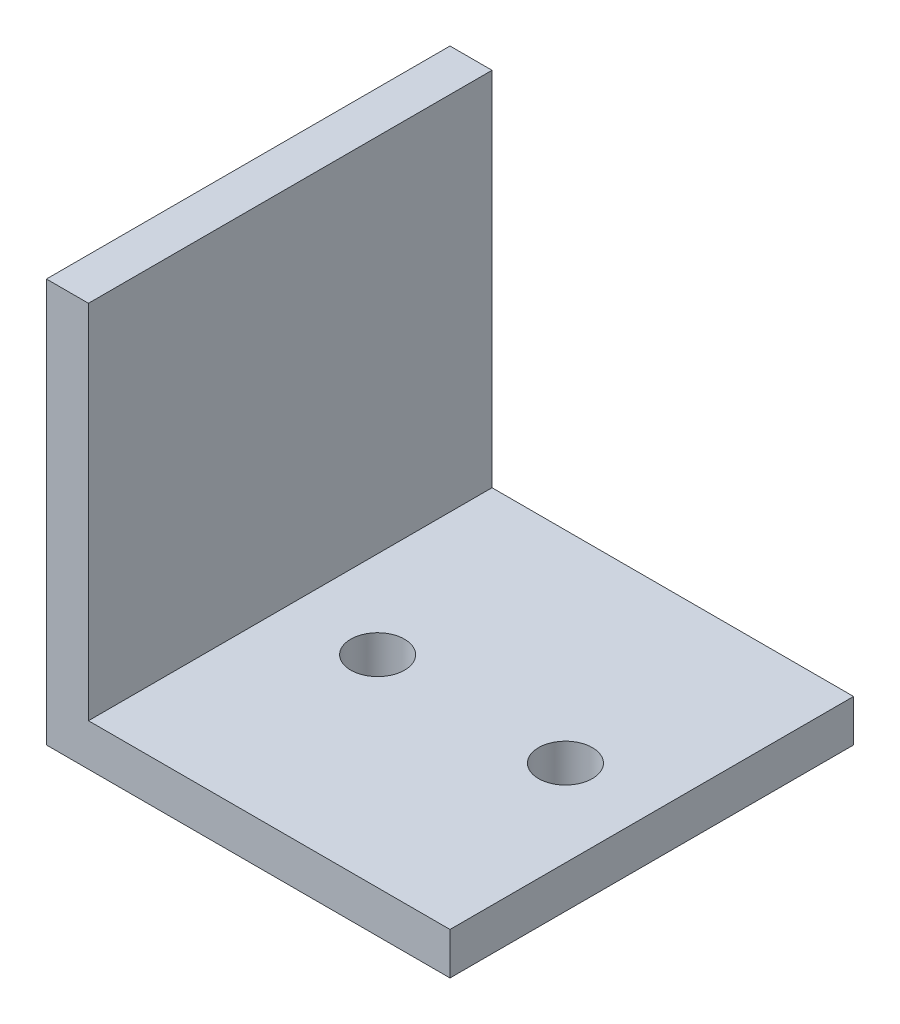
ISO-10303-21;
HEADER;
FILE_DESCRIPTION(('STEP AP214'),'2;1');
FILE_NAME('part.step','',(''),(''),'','','');
FILE_SCHEMA(('AUTOMOTIVE_DESIGN { 1 0 10303 214 1 1 1 1 }'));
ENDSEC;
DATA;
#1=APPLICATION_CONTEXT('core data for automotive mechanical design processes');
#2=APPLICATION_PROTOCOL_DEFINITION('international standard','automotive_design',2000,#1);
#3=PRODUCT_CONTEXT('',#1,'mechanical');
#4=PRODUCT('Part','Part','',(#3));
#5=PRODUCT_RELATED_PRODUCT_CATEGORY('part','',(#4));
#6=PRODUCT_DEFINITION_FORMATION('','',#4);
#7=PRODUCT_DEFINITION_CONTEXT('part definition',#1,'design');
#8=PRODUCT_DEFINITION('design','',#6,#7);
#9=PRODUCT_DEFINITION_SHAPE('','',#8);
#10=(LENGTH_UNIT() NAMED_UNIT(*) SI_UNIT(.MILLI.,.METRE.));
#11=(NAMED_UNIT(*) PLANE_ANGLE_UNIT() SI_UNIT($,.RADIAN.));
#12=(NAMED_UNIT(*) SI_UNIT($,.STERADIAN.) SOLID_ANGLE_UNIT());
#13=UNCERTAINTY_MEASURE_WITH_UNIT(LENGTH_MEASURE(1.E-05),#10,'distance_accuracy_value','');
#14=(GEOMETRIC_REPRESENTATION_CONTEXT(3) GLOBAL_UNCERTAINTY_ASSIGNED_CONTEXT((#13)) GLOBAL_UNIT_ASSIGNED_CONTEXT((#10,
#11,#12)) REPRESENTATION_CONTEXT('',''));
#15=CARTESIAN_POINT('',(0.,0.,0.));
#16=DIRECTION('',(0.,0.,1.));
#17=DIRECTION('',(1.,0.,0.));
#18=AXIS2_PLACEMENT_3D('',#15,#16,#17);
#19=CARTESIAN_POINT('',(-26.875,0.,30.));
#20=DIRECTION('',(-1.,0.,0.));
#21=DIRECTION('',(0.,0.,1.));
#22=AXIS2_PLACEMENT_3D('',#19,#20,#21);
#23=PLANE('',#22);
#24=DIRECTION('',(0.,1.,0.));
#25=VECTOR('',#24,1.);
#26=CARTESIAN_POINT('',(-26.875,0.,0.));
#27=LINE('',#26,#25);
#28=CARTESIAN_POINT('',(-26.875,3.125,0.));
#29=VERTEX_POINT('',#28);
#30=CARTESIAN_POINT('',(-26.875,30.,0.));
#31=VERTEX_POINT('',#30);
#32=EDGE_CURVE('E116',#29,#31,#27,.T.);
#33=ORIENTED_EDGE('',*,*,#32,.T.);
#34=DIRECTION('',(0.,0.,-1.));
#35=VECTOR('',#34,1.);
#36=CARTESIAN_POINT('',(-26.875,30.,30.));
#37=LINE('',#36,#35);
#38=CARTESIAN_POINT('',(-26.875,30.,30.));
#39=VERTEX_POINT('',#38);
#40=EDGE_CURVE('E11',#39,#31,#37,.T.);
#41=ORIENTED_EDGE('',*,*,#40,.F.);
#42=DIRECTION('',(0.,1.,0.));
#43=VECTOR('',#42,1.);
#44=CARTESIAN_POINT('',(-26.875,0.,30.));
#45=LINE('',#44,#43);
#46=CARTESIAN_POINT('',(-26.875,3.125,30.));
#47=VERTEX_POINT('',#46);
#48=EDGE_CURVE('E81',#47,#39,#45,.T.);
#49=ORIENTED_EDGE('',*,*,#48,.F.);
#50=DIRECTION('',(0.,0.,-1.));
#51=VECTOR('',#50,1.);
#52=CARTESIAN_POINT('',(-26.875,3.125,30.));
#53=LINE('',#52,#51);
#54=EDGE_CURVE('E112',#47,#29,#53,.T.);
#55=ORIENTED_EDGE('',*,*,#54,.T.);
#56=EDGE_LOOP('',(#33,#41,#49,#55));
#57=FACE_BOUND('',#56,.T.);
#58=ADVANCED_FACE('F35',(#57),#23,.F.);
#59=CARTESIAN_POINT('',(-30.,30.,30.));
#60=DIRECTION('',(0.,1.,0.));
#61=DIRECTION('',(0.,0.,1.));
#62=AXIS2_PLACEMENT_3D('',#59,#60,#61);
#63=PLANE('',#62);
#64=DIRECTION('',(1.,0.,0.));
#65=VECTOR('',#64,1.);
#66=CARTESIAN_POINT('',(-30.,30.,0.));
#67=LINE('',#66,#65);
#68=CARTESIAN_POINT('',(-30.,30.,0.));
#69=VERTEX_POINT('',#68);
#70=EDGE_CURVE('E119',#69,#31,#67,.T.);
#71=ORIENTED_EDGE('',*,*,#70,.F.);
#72=DIRECTION('',(0.,0.,-1.));
#73=VECTOR('',#72,1.);
#74=CARTESIAN_POINT('',(-30.,30.,30.));
#75=LINE('',#74,#73);
#76=CARTESIAN_POINT('',(-30.,30.,30.));
#77=VERTEX_POINT('',#76);
#78=EDGE_CURVE('E43',#77,#69,#75,.T.);
#79=ORIENTED_EDGE('',*,*,#78,.F.);
#80=DIRECTION('',(1.,0.,0.));
#81=VECTOR('',#80,1.);
#82=CARTESIAN_POINT('',(-30.,30.,30.));
#83=LINE('',#82,#81);
#84=EDGE_CURVE('E185',#77,#39,#83,.T.);
#85=ORIENTED_EDGE('',*,*,#84,.T.);
#86=ORIENTED_EDGE('',*,*,#40,.T.);
#87=EDGE_LOOP('',(#71,#79,#85,#86));
#88=FACE_BOUND('',#87,.T.);
#89=ADVANCED_FACE('F138',(#88),#63,.T.);
#90=CARTESIAN_POINT('',(-30.,0.,30.));
#91=DIRECTION('',(-1.,0.,0.));
#92=DIRECTION('',(0.,0.,1.));
#93=AXIS2_PLACEMENT_3D('',#90,#91,#92);
#94=PLANE('',#93);
#95=DIRECTION('',(0.,1.,0.));
#96=VECTOR('',#95,1.);
#97=CARTESIAN_POINT('',(-30.,0.,0.));
#98=LINE('',#97,#96);
#99=CARTESIAN_POINT('',(-30.,0.,0.));
#100=VERTEX_POINT('',#99);
#101=EDGE_CURVE('E123',#100,#69,#98,.T.);
#102=ORIENTED_EDGE('',*,*,#101,.F.);
#103=DIRECTION('',(0.,0.,-1.));
#104=VECTOR('',#103,1.);
#105=CARTESIAN_POINT('',(-30.,0.,30.));
#106=LINE('',#105,#104);
#107=CARTESIAN_POINT('',(-30.,0.,30.));
#108=VERTEX_POINT('',#107);
#109=EDGE_CURVE('E102',#108,#100,#106,.T.);
#110=ORIENTED_EDGE('',*,*,#109,.F.);
#111=DIRECTION('',(0.,1.,0.));
#112=VECTOR('',#111,1.);
#113=CARTESIAN_POINT('',(-30.,0.,30.));
#114=LINE('',#113,#112);
#115=EDGE_CURVE('E108',#108,#77,#114,.T.);
#116=ORIENTED_EDGE('',*,*,#115,.T.);
#117=ORIENTED_EDGE('',*,*,#78,.T.);
#118=EDGE_LOOP('',(#102,#110,#116,#117));
#119=FACE_BOUND('',#118,.T.);
#120=ADVANCED_FACE('F135',(#119),#94,.T.);
#121=CARTESIAN_POINT('',(0.,0.,30.));
#122=DIRECTION('',(0.,-1.,0.));
#123=DIRECTION('',(1.,0.,0.));
#124=AXIS2_PLACEMENT_3D('',#121,#122,#123);
#125=PLANE('',#124);
#126=CARTESIAN_POINT('',(-20.3808796720654,0.,15.));
#127=DIRECTION('',(0.,-1.,0.));
#128=DIRECTION('',(1.,0.,0.));
#129=AXIS2_PLACEMENT_3D('',#126,#127,#128);
#130=CIRCLE('',#129,2.);
#131=CARTESIAN_POINT('',(-18.3808796720654,0.,15.));
#132=VERTEX_POINT('',#131);
#133=EDGE_CURVE('E174',#132,#132,#130,.T.);
#134=ORIENTED_EDGE('',*,*,#133,.F.);
#135=EDGE_LOOP('',(#134));
#136=FACE_BOUND('',#135,.T.);
#137=CARTESIAN_POINT('',(-6.41769287395537,0.,15.));
#138=DIRECTION('',(0.,-1.,0.));
#139=DIRECTION('',(1.,0.,0.));
#140=AXIS2_PLACEMENT_3D('',#137,#138,#139);
#141=CIRCLE('',#140,2.);
#142=CARTESIAN_POINT('',(-4.41769287395537,0.,15.));
#143=VERTEX_POINT('',#142);
#144=EDGE_CURVE('E120',#143,#143,#141,.T.);
#145=ORIENTED_EDGE('',*,*,#144,.F.);
#146=EDGE_LOOP('',(#145));
#147=FACE_BOUND('',#146,.T.);
#148=DIRECTION('',(-1.,0.,0.));
#149=VECTOR('',#148,1.);
#150=CARTESIAN_POINT('',(0.,0.,0.));
#151=LINE('',#150,#149);
#152=CARTESIAN_POINT('',(0.,0.,0.));
#153=VERTEX_POINT('',#152);
#154=EDGE_CURVE('E97',#153,#100,#151,.T.);
#155=ORIENTED_EDGE('',*,*,#154,.F.);
#156=DIRECTION('',(0.,0.,-1.));
#157=VECTOR('',#156,1.);
#158=CARTESIAN_POINT('',(0.,0.,30.));
#159=LINE('',#158,#157);
#160=CARTESIAN_POINT('',(0.,0.,30.));
#161=VERTEX_POINT('',#160);
#162=EDGE_CURVE('E92',#161,#153,#159,.T.);
#163=ORIENTED_EDGE('',*,*,#162,.F.);
#164=DIRECTION('',(-1.,0.,0.));
#165=VECTOR('',#164,1.);
#166=CARTESIAN_POINT('',(0.,0.,30.));
#167=LINE('',#166,#165);
#168=EDGE_CURVE('E95',#161,#108,#167,.T.);
#169=ORIENTED_EDGE('',*,*,#168,.T.);
#170=ORIENTED_EDGE('',*,*,#109,.T.);
#171=EDGE_LOOP('',(#155,#163,#169,#170));
#172=FACE_BOUND('',#171,.T.);
#173=ADVANCED_FACE('F94',(#136,#147,#172),#125,.T.);
#174=CARTESIAN_POINT('',(0.,3.125,30.));
#175=DIRECTION('',(1.,0.,0.));
#176=DIRECTION('',(0.,1.,0.));
#177=AXIS2_PLACEMENT_3D('',#174,#175,#176);
#178=PLANE('',#177);
#179=DIRECTION('',(0.,-1.,0.));
#180=VECTOR('',#179,1.);
#181=CARTESIAN_POINT('',(0.,3.125,0.));
#182=LINE('',#181,#180);
#183=CARTESIAN_POINT('',(0.,3.125,0.));
#184=VERTEX_POINT('',#183);
#185=EDGE_CURVE('E127',#184,#153,#182,.T.);
#186=ORIENTED_EDGE('',*,*,#185,.F.);
#187=DIRECTION('',(0.,0.,-1.));
#188=VECTOR('',#187,1.);
#189=CARTESIAN_POINT('',(0.,3.125,30.));
#190=LINE('',#189,#188);
#191=CARTESIAN_POINT('',(0.,3.125,30.));
#192=VERTEX_POINT('',#191);
#193=EDGE_CURVE('E72',#192,#184,#190,.T.);
#194=ORIENTED_EDGE('',*,*,#193,.F.);
#195=DIRECTION('',(0.,-1.,0.));
#196=VECTOR('',#195,1.);
#197=CARTESIAN_POINT('',(0.,3.125,30.));
#198=LINE('',#197,#196);
#199=EDGE_CURVE('E106',#192,#161,#198,.T.);
#200=ORIENTED_EDGE('',*,*,#199,.T.);
#201=ORIENTED_EDGE('',*,*,#162,.T.);
#202=EDGE_LOOP('',(#186,#194,#200,#201));
#203=FACE_BOUND('',#202,.T.);
#204=ADVANCED_FACE('F110',(#203),#178,.T.);
#205=CARTESIAN_POINT('',(0.,3.125,30.));
#206=DIRECTION('',(0.,-1.,0.));
#207=DIRECTION('',(1.,0.,0.));
#208=AXIS2_PLACEMENT_3D('',#205,#206,#207);
#209=PLANE('',#208);
#210=CARTESIAN_POINT('',(-20.3808796720654,3.125,15.));
#211=DIRECTION('',(0.,1.,0.));
#212=DIRECTION('',(-1.,0.,0.));
#213=AXIS2_PLACEMENT_3D('',#210,#211,#212);
#214=CIRCLE('',#213,2.);
#215=CARTESIAN_POINT('',(-22.3808796720654,3.125,15.));
#216=VERTEX_POINT('',#215);
#217=EDGE_CURVE('E187',#216,#216,#214,.T.);
#218=ORIENTED_EDGE('',*,*,#217,.F.);
#219=EDGE_LOOP('',(#218));
#220=FACE_BOUND('',#219,.T.);
#221=CARTESIAN_POINT('',(-6.41769287395537,3.125,15.));
#222=DIRECTION('',(0.,1.,0.));
#223=DIRECTION('',(-1.,0.,0.));
#224=AXIS2_PLACEMENT_3D('',#221,#222,#223);
#225=CIRCLE('',#224,2.);
#226=CARTESIAN_POINT('',(-8.41769287395537,3.125,15.));
#227=VERTEX_POINT('',#226);
#228=EDGE_CURVE('E178',#227,#227,#225,.T.);
#229=ORIENTED_EDGE('',*,*,#228,.F.);
#230=EDGE_LOOP('',(#229));
#231=FACE_BOUND('',#230,.T.);
#232=DIRECTION('',(-1.,0.,0.));
#233=VECTOR('',#232,1.);
#234=CARTESIAN_POINT('',(0.,3.125,0.));
#235=LINE('',#234,#233);
#236=EDGE_CURVE('E75',#184,#29,#235,.T.);
#237=ORIENTED_EDGE('',*,*,#236,.T.);
#238=ORIENTED_EDGE('',*,*,#54,.F.);
#239=DIRECTION('',(-1.,0.,0.));
#240=VECTOR('',#239,1.);
#241=CARTESIAN_POINT('',(0.,3.125,30.));
#242=LINE('',#241,#240);
#243=EDGE_CURVE('E51',#192,#47,#242,.T.);
#244=ORIENTED_EDGE('',*,*,#243,.F.);
#245=ORIENTED_EDGE('',*,*,#193,.T.);
#246=EDGE_LOOP('',(#237,#238,#244,#245));
#247=FACE_BOUND('',#246,.T.);
#248=ADVANCED_FACE('F143',(#220,#231,#247),#209,.F.);
#249=CARTESIAN_POINT('',(0.,0.,30.));
#250=DIRECTION('',(0.,0.,-1.));
#251=DIRECTION('',(-1.,0.,0.));
#252=AXIS2_PLACEMENT_3D('',#249,#250,#251);
#253=PLANE('',#252);
#254=ORIENTED_EDGE('',*,*,#48,.T.);
#255=ORIENTED_EDGE('',*,*,#84,.F.);
#256=ORIENTED_EDGE('',*,*,#115,.F.);
#257=ORIENTED_EDGE('',*,*,#168,.F.);
#258=ORIENTED_EDGE('',*,*,#199,.F.);
#259=ORIENTED_EDGE('',*,*,#243,.T.);
#260=EDGE_LOOP('',(#254,#255,#256,#257,#258,#259));
#261=FACE_BOUND('',#260,.T.);
#262=ADVANCED_FACE('F105',(#261),#253,.F.);
#263=CARTESIAN_POINT('',(0.,0.,0.));
#264=DIRECTION('',(0.,0.,-1.));
#265=DIRECTION('',(-1.,0.,0.));
#266=AXIS2_PLACEMENT_3D('',#263,#264,#265);
#267=PLANE('',#266);
#268=ORIENTED_EDGE('',*,*,#32,.F.);
#269=ORIENTED_EDGE('',*,*,#236,.F.);
#270=ORIENTED_EDGE('',*,*,#185,.T.);
#271=ORIENTED_EDGE('',*,*,#154,.T.);
#272=ORIENTED_EDGE('',*,*,#101,.T.);
#273=ORIENTED_EDGE('',*,*,#70,.T.);
#274=EDGE_LOOP('',(#268,#269,#270,#271,#272,#273));
#275=FACE_BOUND('',#274,.T.);
#276=ADVANCED_FACE('F141',(#275),#267,.T.);
#277=CARTESIAN_POINT('',(-6.41769287395536,-26.875,15.));
#278=DIRECTION('',(0.,1.,0.));
#279=DIRECTION('',(-1.,0.,0.));
#280=AXIS2_PLACEMENT_3D('',#277,#278,#279);
#281=CYLINDRICAL_SURFACE('',#280,2.);
#282=ORIENTED_EDGE('',*,*,#144,.T.);
#283=EDGE_LOOP('',(#282));
#284=FACE_BOUND('',#283,.T.);
#285=ORIENTED_EDGE('',*,*,#228,.T.);
#286=EDGE_LOOP('',(#285));
#287=FACE_BOUND('',#286,.T.);
#288=ADVANCED_FACE('F192',(#284,#287),#281,.F.);
#289=CARTESIAN_POINT('',(-20.3808796720654,-26.875,15.));
#290=DIRECTION('',(0.,1.,0.));
#291=DIRECTION('',(-1.,0.,0.));
#292=AXIS2_PLACEMENT_3D('',#289,#290,#291);
#293=CYLINDRICAL_SURFACE('',#292,2.);
#294=ORIENTED_EDGE('',*,*,#133,.T.);
#295=EDGE_LOOP('',(#294));
#296=FACE_BOUND('',#295,.T.);
#297=ORIENTED_EDGE('',*,*,#217,.T.);
#298=EDGE_LOOP('',(#297));
#299=FACE_BOUND('',#298,.T.);
#300=ADVANCED_FACE('F190',(#296,#299),#293,.F.);
#301=CLOSED_SHELL('',(#58,#89,#120,#173,#204,#248,#262,#276,#288,#300));
#302=MANIFOLD_SOLID_BREP('B2',#301);
#303=ADVANCED_BREP_SHAPE_REPRESENTATION('',(#18,#302),#14);
#304=SHAPE_DEFINITION_REPRESENTATION(#9,#303);
ENDSEC;
END-ISO-10303-21;
